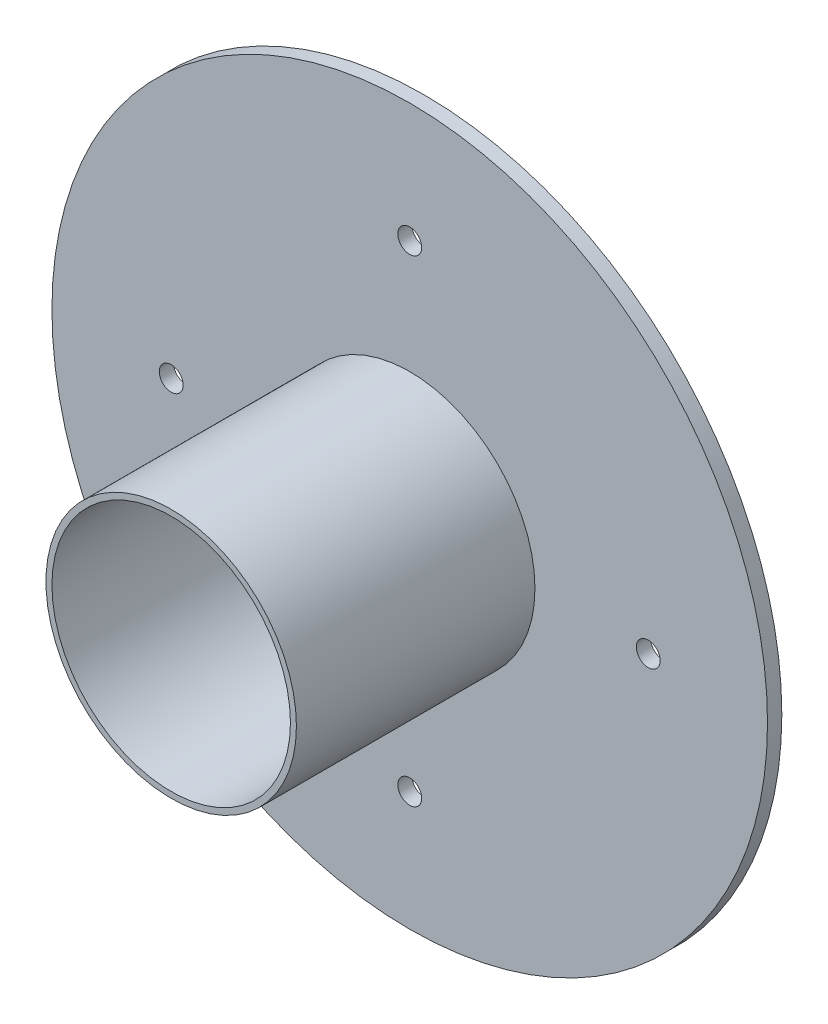
ISO-10303-21;
HEADER;
FILE_DESCRIPTION(('STEP AP214'),'2;1');
FILE_NAME('part.step','',(''),(''),'','','');
FILE_SCHEMA(('AUTOMOTIVE_DESIGN { 1 0 10303 214 1 1 1 1 }'));
ENDSEC;
DATA;
#1=APPLICATION_CONTEXT('core data for automotive mechanical design processes');
#2=APPLICATION_PROTOCOL_DEFINITION('international standard','automotive_design',2000,#1);
#3=PRODUCT_CONTEXT('',#1,'mechanical');
#4=PRODUCT('Part','Part','',(#3));
#5=PRODUCT_RELATED_PRODUCT_CATEGORY('part','',(#4));
#6=PRODUCT_DEFINITION_FORMATION('','',#4);
#7=PRODUCT_DEFINITION_CONTEXT('part definition',#1,'design');
#8=PRODUCT_DEFINITION('design','',#6,#7);
#9=PRODUCT_DEFINITION_SHAPE('','',#8);
#10=(LENGTH_UNIT() NAMED_UNIT(*) SI_UNIT(.MILLI.,.METRE.));
#11=(NAMED_UNIT(*) PLANE_ANGLE_UNIT() SI_UNIT($,.RADIAN.));
#12=(NAMED_UNIT(*) SI_UNIT($,.STERADIAN.) SOLID_ANGLE_UNIT());
#13=UNCERTAINTY_MEASURE_WITH_UNIT(LENGTH_MEASURE(1.E-05),#10,'distance_accuracy_value','');
#14=(GEOMETRIC_REPRESENTATION_CONTEXT(3) GLOBAL_UNCERTAINTY_ASSIGNED_CONTEXT((#13)) GLOBAL_UNIT_ASSIGNED_CONTEXT((#10,
#11,#12)) REPRESENTATION_CONTEXT('',''));
#15=CARTESIAN_POINT('',(0.,0.,0.));
#16=DIRECTION('',(0.,0.,1.));
#17=DIRECTION('',(1.,0.,0.));
#18=AXIS2_PLACEMENT_3D('',#15,#16,#17);
#19=CARTESIAN_POINT('',(0.,0.,6.));
#20=DIRECTION('',(0.,0.,-1.));
#21=DIRECTION('',(-1.,0.,0.));
#22=AXIS2_PLACEMENT_3D('',#19,#20,#21);
#23=CYLINDRICAL_SURFACE('',#22,150.);
#24=CARTESIAN_POINT('',(0.,0.,6.));
#25=DIRECTION('',(0.,0.,1.));
#26=DIRECTION('',(1.,0.,0.));
#27=AXIS2_PLACEMENT_3D('',#24,#25,#26);
#28=CIRCLE('',#27,150.);
#29=CARTESIAN_POINT('',(150.,0.,6.));
#30=VERTEX_POINT('',#29);
#31=EDGE_CURVE('E44',#30,#30,#28,.T.);
#32=ORIENTED_EDGE('',*,*,#31,.F.);
#33=EDGE_LOOP('',(#32));
#34=FACE_BOUND('',#33,.T.);
#35=CARTESIAN_POINT('',(0.,0.,0.));
#36=DIRECTION('',(0.,0.,1.));
#37=DIRECTION('',(1.,0.,0.));
#38=AXIS2_PLACEMENT_3D('',#35,#36,#37);
#39=CIRCLE('',#38,150.);
#40=CARTESIAN_POINT('',(150.,0.,0.));
#41=VERTEX_POINT('',#40);
#42=EDGE_CURVE('E49',#41,#41,#39,.T.);
#43=ORIENTED_EDGE('',*,*,#42,.T.);
#44=EDGE_LOOP('',(#43));
#45=FACE_BOUND('',#44,.T.);
#46=ADVANCED_FACE('F37',(#34,#45),#23,.T.);
#47=CARTESIAN_POINT('',(0.,0.,6.));
#48=DIRECTION('',(0.,0.,1.));
#49=DIRECTION('',(1.,0.,0.));
#50=AXIS2_PLACEMENT_3D('',#47,#48,#49);
#51=PLANE('',#50);
#52=CARTESIAN_POINT('',(1.04744440165294E-12,100.,6.));
#53=DIRECTION('',(0.,0.,1.));
#54=DIRECTION('',(1.,0.,0.));
#55=AXIS2_PLACEMENT_3D('',#52,#53,#54);
#56=CIRCLE('',#55,5.);
#57=CARTESIAN_POINT('',(5.00000000000105,100.,6.));
#58=VERTEX_POINT('',#57);
#59=EDGE_CURVE('E57',#58,#58,#56,.T.);
#60=ORIENTED_EDGE('',*,*,#59,.F.);
#61=EDGE_LOOP('',(#60));
#62=FACE_BOUND('',#61,.T.);
#63=CARTESIAN_POINT('',(100.,0.,6.));
#64=DIRECTION('',(0.,0.,1.));
#65=DIRECTION('',(1.,0.,0.));
#66=AXIS2_PLACEMENT_3D('',#63,#64,#65);
#67=CIRCLE('',#66,5.);
#68=CARTESIAN_POINT('',(105.,0.,6.));
#69=VERTEX_POINT('',#68);
#70=EDGE_CURVE('E195',#69,#69,#67,.T.);
#71=ORIENTED_EDGE('',*,*,#70,.F.);
#72=EDGE_LOOP('',(#71));
#73=FACE_BOUND('',#72,.T.);
#74=CARTESIAN_POINT('',(-3.49148133884313E-13,-100.,6.));
#75=DIRECTION('',(0.,0.,1.));
#76=DIRECTION('',(1.,0.,0.));
#77=AXIS2_PLACEMENT_3D('',#74,#75,#76);
#78=CIRCLE('',#77,5.);
#79=CARTESIAN_POINT('',(4.99999999999965,-100.,6.));
#80=VERTEX_POINT('',#79);
#81=EDGE_CURVE('E198',#80,#80,#78,.T.);
#82=ORIENTED_EDGE('',*,*,#81,.F.);
#83=EDGE_LOOP('',(#82));
#84=FACE_BOUND('',#83,.T.);
#85=CARTESIAN_POINT('',(-100.,6.98296267768627E-13,6.));
#86=DIRECTION('',(0.,0.,1.));
#87=DIRECTION('',(1.,0.,0.));
#88=AXIS2_PLACEMENT_3D('',#85,#86,#87);
#89=CIRCLE('',#88,5.00000000000001);
#90=CARTESIAN_POINT('',(-95.,6.98296267768627E-13,6.));
#91=VERTEX_POINT('',#90);
#92=EDGE_CURVE('E77',#91,#91,#89,.T.);
#93=ORIENTED_EDGE('',*,*,#92,.F.);
#94=EDGE_LOOP('',(#93));
#95=FACE_BOUND('',#94,.T.);
#96=CARTESIAN_POINT('',(0.,0.,6.));
#97=DIRECTION('',(0.,0.,1.));
#98=DIRECTION('',(1.,0.,0.));
#99=AXIS2_PLACEMENT_3D('',#96,#97,#98);
#100=CIRCLE('',#99,52.5);
#101=CARTESIAN_POINT('',(52.5,0.,6.));
#102=VERTEX_POINT('',#101);
#103=EDGE_CURVE('E68',#102,#102,#100,.T.);
#104=ORIENTED_EDGE('',*,*,#103,.F.);
#105=EDGE_LOOP('',(#104));
#106=FACE_BOUND('',#105,.T.);
#107=ORIENTED_EDGE('',*,*,#31,.T.);
#108=EDGE_LOOP('',(#107));
#109=FACE_BOUND('',#108,.T.);
#110=ADVANCED_FACE('F89',(#62,#73,#84,#95,#106,#109),#51,.T.);
#111=CARTESIAN_POINT('',(0.,0.,0.));
#112=DIRECTION('',(0.,0.,1.));
#113=DIRECTION('',(1.,0.,0.));
#114=AXIS2_PLACEMENT_3D('',#111,#112,#113);
#115=PLANE('',#114);
#116=CARTESIAN_POINT('',(1.04744440165294E-12,100.,0.));
#117=DIRECTION('',(0.,0.,1.));
#118=DIRECTION('',(1.,0.,0.));
#119=AXIS2_PLACEMENT_3D('',#116,#117,#118);
#120=CIRCLE('',#119,5.);
#121=CARTESIAN_POINT('',(5.00000000000105,100.,0.));
#122=VERTEX_POINT('',#121);
#123=EDGE_CURVE('E40',#122,#122,#120,.T.);
#124=ORIENTED_EDGE('',*,*,#123,.T.);
#125=EDGE_LOOP('',(#124));
#126=FACE_BOUND('',#125,.T.);
#127=CARTESIAN_POINT('',(100.,0.,0.));
#128=DIRECTION('',(0.,0.,1.));
#129=DIRECTION('',(1.,0.,0.));
#130=AXIS2_PLACEMENT_3D('',#127,#128,#129);
#131=CIRCLE('',#130,5.);
#132=CARTESIAN_POINT('',(105.,0.,0.));
#133=VERTEX_POINT('',#132);
#134=EDGE_CURVE('E59',#133,#133,#131,.T.);
#135=ORIENTED_EDGE('',*,*,#134,.T.);
#136=EDGE_LOOP('',(#135));
#137=FACE_BOUND('',#136,.T.);
#138=CARTESIAN_POINT('',(-3.49148133884313E-13,-100.,0.));
#139=DIRECTION('',(0.,0.,1.));
#140=DIRECTION('',(1.,0.,0.));
#141=AXIS2_PLACEMENT_3D('',#138,#139,#140);
#142=CIRCLE('',#141,5.);
#143=CARTESIAN_POINT('',(4.99999999999965,-100.,0.));
#144=VERTEX_POINT('',#143);
#145=EDGE_CURVE('E56',#144,#144,#142,.T.);
#146=ORIENTED_EDGE('',*,*,#145,.T.);
#147=EDGE_LOOP('',(#146));
#148=FACE_BOUND('',#147,.T.);
#149=CARTESIAN_POINT('',(-100.,6.98296267768627E-13,0.));
#150=DIRECTION('',(0.,0.,1.));
#151=DIRECTION('',(1.,0.,0.));
#152=AXIS2_PLACEMENT_3D('',#149,#150,#151);
#153=CIRCLE('',#152,5.00000000000001);
#154=CARTESIAN_POINT('',(-95.,6.98296267768627E-13,0.));
#155=VERTEX_POINT('',#154);
#156=EDGE_CURVE('E53',#155,#155,#153,.T.);
#157=ORIENTED_EDGE('',*,*,#156,.T.);
#158=EDGE_LOOP('',(#157));
#159=FACE_BOUND('',#158,.T.);
#160=ORIENTED_EDGE('',*,*,#42,.F.);
#161=EDGE_LOOP('',(#160));
#162=FACE_BOUND('',#161,.T.);
#163=ADVANCED_FACE('F86',(#126,#137,#148,#159,#162),#115,.F.);
#164=CARTESIAN_POINT('',(0.,0.,106.));
#165=DIRECTION('',(0.,0.,1.));
#166=DIRECTION('',(1.,0.,0.));
#167=AXIS2_PLACEMENT_3D('',#164,#165,#166);
#168=PLANE('',#167);
#169=CARTESIAN_POINT('',(0.,0.,106.));
#170=DIRECTION('',(0.,0.,1.));
#171=DIRECTION('',(1.,0.,0.));
#172=AXIS2_PLACEMENT_3D('',#169,#170,#171);
#173=CIRCLE('',#172,52.5);
#174=CARTESIAN_POINT('',(52.5,0.,106.));
#175=VERTEX_POINT('',#174);
#176=EDGE_CURVE('E73',#175,#175,#173,.T.);
#177=ORIENTED_EDGE('',*,*,#176,.T.);
#178=EDGE_LOOP('',(#177));
#179=FACE_BOUND('',#178,.T.);
#180=CARTESIAN_POINT('',(0.,0.,106.));
#181=DIRECTION('',(0.,0.,1.));
#182=DIRECTION('',(1.,0.,0.));
#183=AXIS2_PLACEMENT_3D('',#180,#181,#182);
#184=CIRCLE('',#183,50.);
#185=CARTESIAN_POINT('',(50.,0.,106.));
#186=VERTEX_POINT('',#185);
#187=EDGE_CURVE('E64',#186,#186,#184,.T.);
#188=ORIENTED_EDGE('',*,*,#187,.F.);
#189=EDGE_LOOP('',(#188));
#190=FACE_BOUND('',#189,.T.);
#191=ADVANCED_FACE('F88',(#179,#190),#168,.T.);
#192=CARTESIAN_POINT('',(0.,0.,106.));
#193=DIRECTION('',(0.,0.,-1.));
#194=DIRECTION('',(-1.,0.,0.));
#195=AXIS2_PLACEMENT_3D('',#192,#193,#194);
#196=CYLINDRICAL_SURFACE('',#195,52.5);
#197=ORIENTED_EDGE('',*,*,#176,.F.);
#198=EDGE_LOOP('',(#197));
#199=FACE_BOUND('',#198,.T.);
#200=ORIENTED_EDGE('',*,*,#103,.T.);
#201=EDGE_LOOP('',(#200));
#202=FACE_BOUND('',#201,.T.);
#203=ADVANCED_FACE('F94',(#199,#202),#196,.T.);
#204=CARTESIAN_POINT('',(0.,0.,106.));
#205=DIRECTION('',(0.,0.,-1.));
#206=DIRECTION('',(-1.,0.,0.));
#207=AXIS2_PLACEMENT_3D('',#204,#205,#206);
#208=CYLINDRICAL_SURFACE('',#207,50.);
#209=ORIENTED_EDGE('',*,*,#187,.T.);
#210=EDGE_LOOP('',(#209));
#211=FACE_BOUND('',#210,.T.);
#212=CARTESIAN_POINT('',(0.,0.,6.00000000000001));
#213=DIRECTION('',(0.,0.,1.));
#214=DIRECTION('',(1.,0.,0.));
#215=AXIS2_PLACEMENT_3D('',#212,#213,#214);
#216=CIRCLE('',#215,50.);
#217=CARTESIAN_POINT('',(50.,0.,6.00000000000001));
#218=VERTEX_POINT('',#217);
#219=EDGE_CURVE('E11',#218,#218,#216,.F.);
#220=ORIENTED_EDGE('',*,*,#219,.T.);
#221=EDGE_LOOP('',(#220));
#222=FACE_BOUND('',#221,.T.);
#223=ADVANCED_FACE('F167',(#211,#222),#208,.F.);
#224=ORIENTED_EDGE('',*,*,#219,.F.);
#225=EDGE_LOOP('',(#224));
#226=FACE_BOUND('',#225,.T.);
#227=ADVANCED_FACE('F98',(#226),#51,.T.);
#228=CARTESIAN_POINT('',(-100.,6.98296267768627E-13,-94.));
#229=DIRECTION('',(0.,0.,1.));
#230=DIRECTION('',(1.,0.,0.));
#231=AXIS2_PLACEMENT_3D('',#228,#229,#230);
#232=CYLINDRICAL_SURFACE('',#231,5.00000000000001);
#233=ORIENTED_EDGE('',*,*,#92,.T.);
#234=EDGE_LOOP('',(#233));
#235=FACE_BOUND('',#234,.T.);
#236=ORIENTED_EDGE('',*,*,#156,.F.);
#237=EDGE_LOOP('',(#236));
#238=FACE_BOUND('',#237,.T.);
#239=ADVANCED_FACE('F124',(#235,#238),#232,.F.);
#240=CARTESIAN_POINT('',(-3.49148133884313E-13,-100.,-94.));
#241=DIRECTION('',(0.,0.,1.));
#242=DIRECTION('',(1.,0.,0.));
#243=AXIS2_PLACEMENT_3D('',#240,#241,#242);
#244=CYLINDRICAL_SURFACE('',#243,5.);
#245=ORIENTED_EDGE('',*,*,#81,.T.);
#246=EDGE_LOOP('',(#245));
#247=FACE_BOUND('',#246,.T.);
#248=ORIENTED_EDGE('',*,*,#145,.F.);
#249=EDGE_LOOP('',(#248));
#250=FACE_BOUND('',#249,.T.);
#251=ADVANCED_FACE('F129',(#247,#250),#244,.F.);
#252=CARTESIAN_POINT('',(100.,0.,-94.));
#253=DIRECTION('',(0.,0.,1.));
#254=DIRECTION('',(1.,0.,0.));
#255=AXIS2_PLACEMENT_3D('',#252,#253,#254);
#256=CYLINDRICAL_SURFACE('',#255,5.);
#257=ORIENTED_EDGE('',*,*,#70,.T.);
#258=EDGE_LOOP('',(#257));
#259=FACE_BOUND('',#258,.T.);
#260=ORIENTED_EDGE('',*,*,#134,.F.);
#261=EDGE_LOOP('',(#260));
#262=FACE_BOUND('',#261,.T.);
#263=ADVANCED_FACE('F140',(#259,#262),#256,.F.);
#264=CARTESIAN_POINT('',(1.04744440165294E-12,100.,-94.));
#265=DIRECTION('',(0.,0.,1.));
#266=DIRECTION('',(1.,0.,0.));
#267=AXIS2_PLACEMENT_3D('',#264,#265,#266);
#268=CYLINDRICAL_SURFACE('',#267,5.);
#269=ORIENTED_EDGE('',*,*,#59,.T.);
#270=EDGE_LOOP('',(#269));
#271=FACE_BOUND('',#270,.T.);
#272=ORIENTED_EDGE('',*,*,#123,.F.);
#273=EDGE_LOOP('',(#272));
#274=FACE_BOUND('',#273,.T.);
#275=ADVANCED_FACE('F150',(#271,#274),#268,.F.);
#276=CLOSED_SHELL('',(#46,#110,#163,#191,#203,#223,#227,#239,#251,#263,#275));
#277=MANIFOLD_SOLID_BREP('B2',#276);
#278=ADVANCED_BREP_SHAPE_REPRESENTATION('',(#18,#277),#14);
#279=SHAPE_DEFINITION_REPRESENTATION(#9,#278);
ENDSEC;
END-ISO-10303-21;
